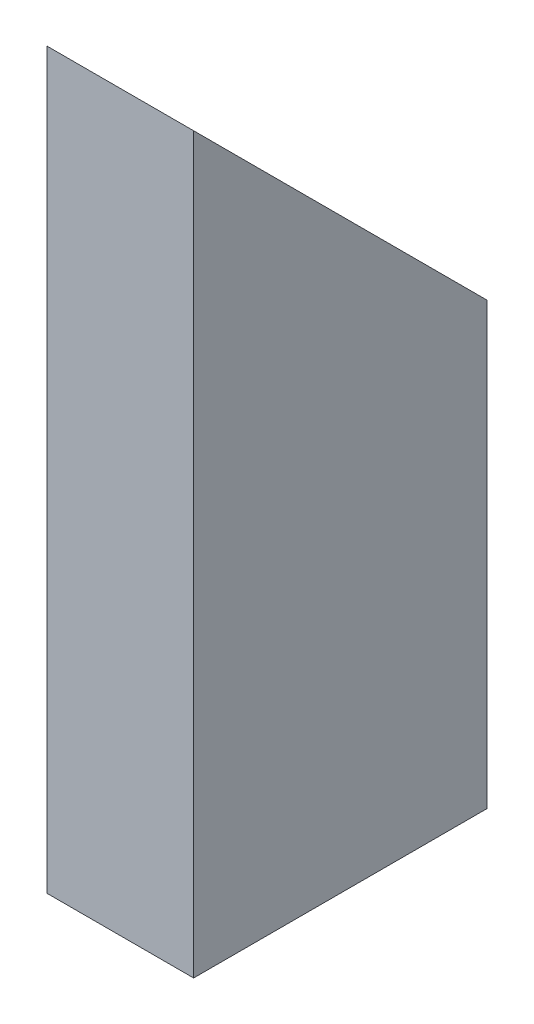
ISO-10303-21;
HEADER;
FILE_DESCRIPTION(('STEP AP214'),'2;1');
FILE_NAME('part.step','',(''),(''),'','','');
FILE_SCHEMA(('AUTOMOTIVE_DESIGN { 1 0 10303 214 1 1 1 1 }'));
ENDSEC;
DATA;
#1=APPLICATION_CONTEXT('core data for automotive mechanical design processes');
#2=APPLICATION_PROTOCOL_DEFINITION('international standard','automotive_design',2000,#1);
#3=PRODUCT_CONTEXT('',#1,'mechanical');
#4=PRODUCT('Part','Part','',(#3));
#5=PRODUCT_RELATED_PRODUCT_CATEGORY('part','',(#4));
#6=PRODUCT_DEFINITION_FORMATION('','',#4);
#7=PRODUCT_DEFINITION_CONTEXT('part definition',#1,'design');
#8=PRODUCT_DEFINITION('design','',#6,#7);
#9=PRODUCT_DEFINITION_SHAPE('','',#8);
#10=(LENGTH_UNIT() NAMED_UNIT(*) SI_UNIT(.MILLI.,.METRE.));
#11=(NAMED_UNIT(*) PLANE_ANGLE_UNIT() SI_UNIT($,.RADIAN.));
#12=(NAMED_UNIT(*) SI_UNIT($,.STERADIAN.) SOLID_ANGLE_UNIT());
#13=UNCERTAINTY_MEASURE_WITH_UNIT(LENGTH_MEASURE(1.E-05),#10,'distance_accuracy_value','');
#14=(GEOMETRIC_REPRESENTATION_CONTEXT(3) GLOBAL_UNCERTAINTY_ASSIGNED_CONTEXT((#13)) GLOBAL_UNIT_ASSIGNED_CONTEXT((#10,
#11,#12)) REPRESENTATION_CONTEXT('',''));
#15=CARTESIAN_POINT('',(0.,0.,0.));
#16=DIRECTION('',(0.,0.,1.));
#17=DIRECTION('',(1.,0.,0.));
#18=AXIS2_PLACEMENT_3D('',#15,#16,#17);
#19=CARTESIAN_POINT('',(0.,0.,0.));
#20=DIRECTION('',(0.,-1.,0.));
#21=DIRECTION('',(0.,0.,-1.));
#22=AXIS2_PLACEMENT_3D('',#19,#20,#21);
#23=PLANE('',#22);
#24=DIRECTION('',(0.,0.,1.));
#25=VECTOR('',#24,1.);
#26=CARTESIAN_POINT('',(0.,0.,0.));
#27=LINE('',#26,#25);
#28=CARTESIAN_POINT('',(0.,0.,-50.8));
#29=VERTEX_POINT('',#28);
#30=CARTESIAN_POINT('',(0.,0.,0.));
#31=VERTEX_POINT('',#30);
#32=EDGE_CURVE('E127',#29,#31,#27,.T.);
#33=ORIENTED_EDGE('',*,*,#32,.F.);
#34=DIRECTION('',(-1.,0.,0.));
#35=VECTOR('',#34,1.);
#36=CARTESIAN_POINT('',(0.,0.,-50.8));
#37=LINE('',#36,#35);
#38=CARTESIAN_POINT('',(25.4,0.,-50.8));
#39=VERTEX_POINT('',#38);
#40=EDGE_CURVE('E104',#39,#29,#37,.T.);
#41=ORIENTED_EDGE('',*,*,#40,.F.);
#42=DIRECTION('',(0.,0.,-1.));
#43=VECTOR('',#42,1.);
#44=CARTESIAN_POINT('',(25.4,0.,0.));
#45=LINE('',#44,#43);
#46=CARTESIAN_POINT('',(25.4,0.,0.));
#47=VERTEX_POINT('',#46);
#48=EDGE_CURVE('E124',#47,#39,#45,.T.);
#49=ORIENTED_EDGE('',*,*,#48,.F.);
#50=DIRECTION('',(1.,0.,0.));
#51=VECTOR('',#50,1.);
#52=CARTESIAN_POINT('',(0.,0.,0.));
#53=LINE('',#52,#51);
#54=EDGE_CURVE('E117',#31,#47,#53,.T.);
#55=ORIENTED_EDGE('',*,*,#54,.F.);
#56=EDGE_LOOP('',(#33,#41,#49,#55));
#57=FACE_BOUND('',#56,.T.);
#58=DIRECTION('',(-1.,0.,0.));
#59=VECTOR('',#58,1.);
#60=CARTESIAN_POINT('',(3.175,0.,-47.625));
#61=LINE('',#60,#59);
#62=CARTESIAN_POINT('',(22.225,0.,-47.625));
#63=VERTEX_POINT('',#62);
#64=CARTESIAN_POINT('',(3.175,0.,-47.625));
#65=VERTEX_POINT('',#64);
#66=EDGE_CURVE('E138',#63,#65,#61,.T.);
#67=ORIENTED_EDGE('',*,*,#66,.T.);
#68=DIRECTION('',(0.,0.,1.));
#69=VECTOR('',#68,1.);
#70=CARTESIAN_POINT('',(3.175,0.,-3.175));
#71=LINE('',#70,#69);
#72=CARTESIAN_POINT('',(3.175,0.,-3.175));
#73=VERTEX_POINT('',#72);
#74=EDGE_CURVE('E147',#65,#73,#71,.T.);
#75=ORIENTED_EDGE('',*,*,#74,.T.);
#76=DIRECTION('',(1.,0.,0.));
#77=VECTOR('',#76,1.);
#78=CARTESIAN_POINT('',(3.175,0.,-3.175));
#79=LINE('',#78,#77);
#80=CARTESIAN_POINT('',(22.225,0.,-3.175));
#81=VERTEX_POINT('',#80);
#82=EDGE_CURVE('E144',#73,#81,#79,.T.);
#83=ORIENTED_EDGE('',*,*,#82,.T.);
#84=DIRECTION('',(0.,0.,-1.));
#85=VECTOR('',#84,1.);
#86=CARTESIAN_POINT('',(22.225,0.,-3.175));
#87=LINE('',#86,#85);
#88=EDGE_CURVE('E141',#81,#63,#87,.T.);
#89=ORIENTED_EDGE('',*,*,#88,.T.);
#90=EDGE_LOOP('',(#67,#75,#83,#89));
#91=FACE_BOUND('',#90,.T.);
#92=ADVANCED_FACE('F33',(#57,#91),#23,.T.);
#93=CARTESIAN_POINT('',(0.,127.,0.));
#94=DIRECTION('',(1.,0.,0.));
#95=DIRECTION('',(0.,0.,-1.));
#96=AXIS2_PLACEMENT_3D('',#93,#94,#95);
#97=PLANE('',#96);
#98=DIRECTION('',(0.,-1.,0.));
#99=VECTOR('',#98,1.);
#100=CARTESIAN_POINT('',(0.,127.,0.));
#101=LINE('',#100,#99);
#102=CARTESIAN_POINT('',(0.,127.,0.));
#103=VERTEX_POINT('',#102);
#104=EDGE_CURVE('E41',#103,#31,#101,.T.);
#105=ORIENTED_EDGE('',*,*,#104,.F.);
#106=DIRECTION('',(0.,-0.707106781186548,-0.707106781186548));
#107=VECTOR('',#106,1.);
#108=CARTESIAN_POINT('',(0.,127.,0.));
#109=LINE('',#108,#107);
#110=CARTESIAN_POINT('',(0.,76.2,-50.8));
#111=VERTEX_POINT('',#110);
#112=EDGE_CURVE('E98',#103,#111,#109,.T.);
#113=ORIENTED_EDGE('',*,*,#112,.T.);
#114=DIRECTION('',(0.,-1.,0.));
#115=VECTOR('',#114,1.);
#116=CARTESIAN_POINT('',(0.,127.,-50.8));
#117=LINE('',#116,#115);
#118=EDGE_CURVE('E103',#111,#29,#117,.T.);
#119=ORIENTED_EDGE('',*,*,#118,.T.);
#120=ORIENTED_EDGE('',*,*,#32,.T.);
#121=EDGE_LOOP('',(#105,#113,#119,#120));
#122=FACE_BOUND('',#121,.T.);
#123=ADVANCED_FACE('F35',(#122),#97,.F.);
#124=CARTESIAN_POINT('',(0.,127.,0.));
#125=DIRECTION('',(0.,0.,-1.));
#126=DIRECTION('',(-1.,0.,0.));
#127=AXIS2_PLACEMENT_3D('',#124,#125,#126);
#128=PLANE('',#127);
#129=ORIENTED_EDGE('',*,*,#54,.T.);
#130=DIRECTION('',(0.,-1.,0.));
#131=VECTOR('',#130,1.);
#132=CARTESIAN_POINT('',(25.4,127.,0.));
#133=LINE('',#132,#131);
#134=CARTESIAN_POINT('',(25.4,127.,0.));
#135=VERTEX_POINT('',#134);
#136=EDGE_CURVE('E111',#135,#47,#133,.T.);
#137=ORIENTED_EDGE('',*,*,#136,.F.);
#138=DIRECTION('',(1.,0.,0.));
#139=VECTOR('',#138,1.);
#140=CARTESIAN_POINT('',(0.,127.,0.));
#141=LINE('',#140,#139);
#142=EDGE_CURVE('E95',#103,#135,#141,.T.);
#143=ORIENTED_EDGE('',*,*,#142,.F.);
#144=ORIENTED_EDGE('',*,*,#104,.T.);
#145=EDGE_LOOP('',(#129,#137,#143,#144));
#146=FACE_BOUND('',#145,.T.);
#147=ADVANCED_FACE('F116',(#146),#128,.F.);
#148=CARTESIAN_POINT('',(25.4,127.,0.));
#149=DIRECTION('',(-1.,0.,0.));
#150=DIRECTION('',(0.,0.,1.));
#151=AXIS2_PLACEMENT_3D('',#148,#149,#150);
#152=PLANE('',#151);
#153=DIRECTION('',(0.,-1.,0.));
#154=VECTOR('',#153,1.);
#155=CARTESIAN_POINT('',(25.4,127.,-50.8));
#156=LINE('',#155,#154);
#157=CARTESIAN_POINT('',(25.4,76.2,-50.8));
#158=VERTEX_POINT('',#157);
#159=EDGE_CURVE('E113',#158,#39,#156,.T.);
#160=ORIENTED_EDGE('',*,*,#159,.F.);
#161=DIRECTION('',(0.,-0.707106781186547,-0.707106781186547));
#162=VECTOR('',#161,1.);
#163=CARTESIAN_POINT('',(25.4,127.,0.));
#164=LINE('',#163,#162);
#165=EDGE_CURVE('E48',#135,#158,#164,.T.);
#166=ORIENTED_EDGE('',*,*,#165,.F.);
#167=ORIENTED_EDGE('',*,*,#136,.T.);
#168=ORIENTED_EDGE('',*,*,#48,.T.);
#169=EDGE_LOOP('',(#160,#166,#167,#168));
#170=FACE_BOUND('',#169,.T.);
#171=ADVANCED_FACE('F109',(#170),#152,.F.);
#172=CARTESIAN_POINT('',(0.,127.,-50.8));
#173=DIRECTION('',(0.,0.,1.));
#174=DIRECTION('',(1.,0.,0.));
#175=AXIS2_PLACEMENT_3D('',#172,#173,#174);
#176=PLANE('',#175);
#177=ORIENTED_EDGE('',*,*,#118,.F.);
#178=DIRECTION('',(1.,0.,0.));
#179=VECTOR('',#178,1.);
#180=CARTESIAN_POINT('',(-101.6,76.2,-50.8));
#181=LINE('',#180,#179);
#182=EDGE_CURVE('E114',#111,#158,#181,.T.);
#183=ORIENTED_EDGE('',*,*,#182,.T.);
#184=ORIENTED_EDGE('',*,*,#159,.T.);
#185=ORIENTED_EDGE('',*,*,#40,.T.);
#186=EDGE_LOOP('',(#177,#183,#184,#185));
#187=FACE_BOUND('',#186,.T.);
#188=ADVANCED_FACE('F158',(#187),#176,.F.);
#189=CARTESIAN_POINT('',(3.175,127.,-3.175));
#190=DIRECTION('',(1.,0.,0.));
#191=DIRECTION('',(0.,0.,-1.));
#192=AXIS2_PLACEMENT_3D('',#189,#190,#191);
#193=PLANE('',#192);
#194=DIRECTION('',(0.,-0.707106781186548,-0.707106781186548));
#195=VECTOR('',#194,1.);
#196=CARTESIAN_POINT('',(3.175,125.4125,-1.5875));
#197=LINE('',#196,#195);
#198=CARTESIAN_POINT('',(3.175,123.825,-3.175));
#199=VERTEX_POINT('',#198);
#200=CARTESIAN_POINT('',(3.175,79.375,-47.625));
#201=VERTEX_POINT('',#200);
#202=EDGE_CURVE('E55',#199,#201,#197,.T.);
#203=ORIENTED_EDGE('',*,*,#202,.F.);
#204=DIRECTION('',(0.,-1.,0.));
#205=VECTOR('',#204,1.);
#206=CARTESIAN_POINT('',(3.175,127.,-3.175));
#207=LINE('',#206,#205);
#208=EDGE_CURVE('E129',#199,#73,#207,.T.);
#209=ORIENTED_EDGE('',*,*,#208,.T.);
#210=ORIENTED_EDGE('',*,*,#74,.F.);
#211=DIRECTION('',(0.,-1.,0.));
#212=VECTOR('',#211,1.);
#213=CARTESIAN_POINT('',(3.175,127.,-47.625));
#214=LINE('',#213,#212);
#215=EDGE_CURVE('E136',#201,#65,#214,.T.);
#216=ORIENTED_EDGE('',*,*,#215,.F.);
#217=EDGE_LOOP('',(#203,#209,#210,#216));
#218=FACE_BOUND('',#217,.T.);
#219=ADVANCED_FACE('F174',(#218),#193,.T.);
#220=CARTESIAN_POINT('',(3.175,127.,-3.175));
#221=DIRECTION('',(0.,0.,-1.));
#222=DIRECTION('',(-1.,0.,0.));
#223=AXIS2_PLACEMENT_3D('',#220,#221,#222);
#224=PLANE('',#223);
#225=DIRECTION('',(-1.,0.,0.));
#226=VECTOR('',#225,1.);
#227=CARTESIAN_POINT('',(3.175,123.825,-3.175));
#228=LINE('',#227,#226);
#229=CARTESIAN_POINT('',(22.225,123.825,-3.175));
#230=VERTEX_POINT('',#229);
#231=EDGE_CURVE('E152',#230,#199,#228,.T.);
#232=ORIENTED_EDGE('',*,*,#231,.F.);
#233=DIRECTION('',(0.,-1.,0.));
#234=VECTOR('',#233,1.);
#235=CARTESIAN_POINT('',(22.225,127.,-3.175));
#236=LINE('',#235,#234);
#237=EDGE_CURVE('E132',#230,#81,#236,.T.);
#238=ORIENTED_EDGE('',*,*,#237,.T.);
#239=ORIENTED_EDGE('',*,*,#82,.F.);
#240=ORIENTED_EDGE('',*,*,#208,.F.);
#241=EDGE_LOOP('',(#232,#238,#239,#240));
#242=FACE_BOUND('',#241,.T.);
#243=ADVANCED_FACE('F179',(#242),#224,.T.);
#244=CARTESIAN_POINT('',(22.225,127.,-3.175));
#245=DIRECTION('',(-1.,0.,0.));
#246=DIRECTION('',(0.,0.,1.));
#247=AXIS2_PLACEMENT_3D('',#244,#245,#246);
#248=PLANE('',#247);
#249=DIRECTION('',(0.,0.707106781186548,0.707106781186548));
#250=VECTOR('',#249,1.);
#251=CARTESIAN_POINT('',(22.225,125.4125,-1.5875));
#252=LINE('',#251,#250);
#253=CARTESIAN_POINT('',(22.225,79.375,-47.625));
#254=VERTEX_POINT('',#253);
#255=EDGE_CURVE('E154',#254,#230,#252,.T.);
#256=ORIENTED_EDGE('',*,*,#255,.F.);
#257=DIRECTION('',(0.,-1.,0.));
#258=VECTOR('',#257,1.);
#259=CARTESIAN_POINT('',(22.225,127.,-47.625));
#260=LINE('',#259,#258);
#261=EDGE_CURVE('E134',#254,#63,#260,.T.);
#262=ORIENTED_EDGE('',*,*,#261,.T.);
#263=ORIENTED_EDGE('',*,*,#88,.F.);
#264=ORIENTED_EDGE('',*,*,#237,.F.);
#265=EDGE_LOOP('',(#256,#262,#263,#264));
#266=FACE_BOUND('',#265,.T.);
#267=ADVANCED_FACE('F183',(#266),#248,.T.);
#268=CARTESIAN_POINT('',(3.175,127.,-47.625));
#269=DIRECTION('',(0.,0.,1.));
#270=DIRECTION('',(1.,0.,0.));
#271=AXIS2_PLACEMENT_3D('',#268,#269,#270);
#272=PLANE('',#271);
#273=DIRECTION('',(1.,0.,0.));
#274=VECTOR('',#273,1.);
#275=CARTESIAN_POINT('',(3.175,79.375,-47.625));
#276=LINE('',#275,#274);
#277=EDGE_CURVE('E11',#201,#254,#276,.T.);
#278=ORIENTED_EDGE('',*,*,#277,.F.);
#279=ORIENTED_EDGE('',*,*,#215,.T.);
#280=ORIENTED_EDGE('',*,*,#66,.F.);
#281=ORIENTED_EDGE('',*,*,#261,.F.);
#282=EDGE_LOOP('',(#278,#279,#280,#281));
#283=FACE_BOUND('',#282,.T.);
#284=ADVANCED_FACE('F171',(#283),#272,.T.);
#285=CARTESIAN_POINT('',(-101.6,127.,0.));
#286=DIRECTION('',(0.,-0.707106781186548,0.707106781186548));
#287=DIRECTION('',(0.,-0.707106781186548,-0.707106781186548));
#288=AXIS2_PLACEMENT_3D('',#285,#286,#287);
#289=PLANE('',#288);
#290=ORIENTED_EDGE('',*,*,#202,.T.);
#291=ORIENTED_EDGE('',*,*,#277,.T.);
#292=ORIENTED_EDGE('',*,*,#255,.T.);
#293=ORIENTED_EDGE('',*,*,#231,.T.);
#294=EDGE_LOOP('',(#290,#291,#292,#293));
#295=FACE_BOUND('',#294,.T.);
#296=ORIENTED_EDGE('',*,*,#142,.T.);
#297=ORIENTED_EDGE('',*,*,#165,.T.);
#298=ORIENTED_EDGE('',*,*,#182,.F.);
#299=ORIENTED_EDGE('',*,*,#112,.F.);
#300=EDGE_LOOP('',(#296,#297,#298,#299));
#301=FACE_BOUND('',#300,.T.);
#302=ADVANCED_FACE('F96',(#295,#301),#289,.F.);
#303=CLOSED_SHELL('',(#92,#123,#147,#171,#188,#219,#243,#267,#284,#302));
#304=MANIFOLD_SOLID_BREP('B2',#303);
#305=ADVANCED_BREP_SHAPE_REPRESENTATION('',(#18,#304),#14);
#306=SHAPE_DEFINITION_REPRESENTATION(#9,#305);
ENDSEC;
END-ISO-10303-21;
